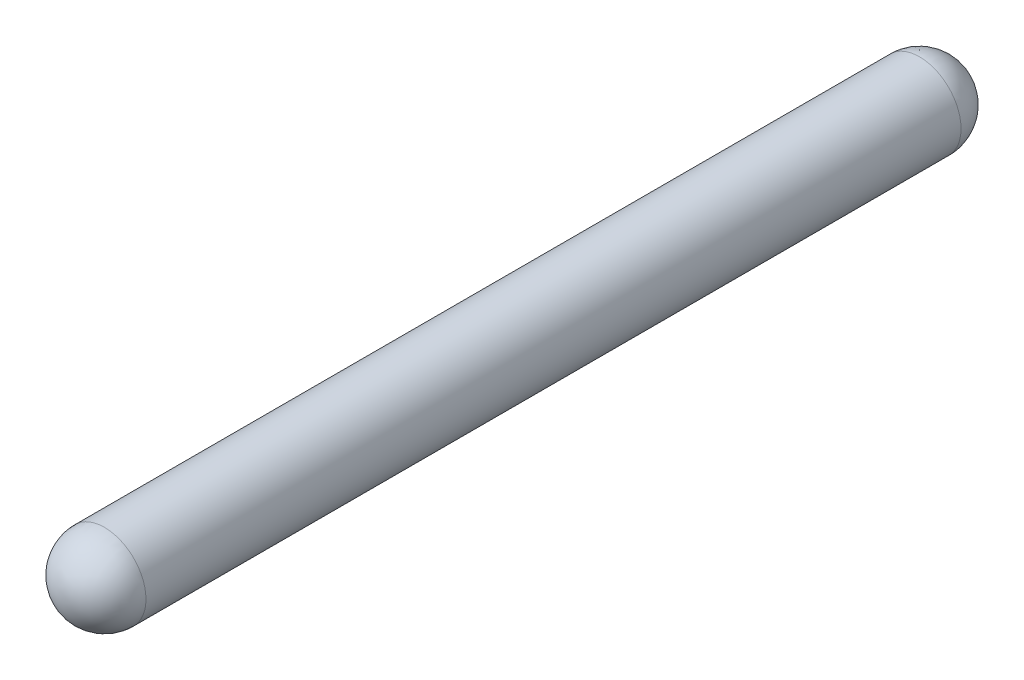
ISO-10303-21;
HEADER;
FILE_DESCRIPTION(('STEP AP214'),'2;1');
FILE_NAME('part.step','',(''),(''),'','','');
FILE_SCHEMA(('AUTOMOTIVE_DESIGN { 1 0 10303 214 1 1 1 1 }'));
ENDSEC;
DATA;
#1=APPLICATION_CONTEXT('core data for automotive mechanical design processes');
#2=APPLICATION_PROTOCOL_DEFINITION('international standard','automotive_design',2000,#1);
#3=PRODUCT_CONTEXT('',#1,'mechanical');
#4=PRODUCT('Part','Part','',(#3));
#5=PRODUCT_RELATED_PRODUCT_CATEGORY('part','',(#4));
#6=PRODUCT_DEFINITION_FORMATION('','',#4);
#7=PRODUCT_DEFINITION_CONTEXT('part definition',#1,'design');
#8=PRODUCT_DEFINITION('design','',#6,#7);
#9=PRODUCT_DEFINITION_SHAPE('','',#8);
#10=(LENGTH_UNIT() NAMED_UNIT(*) SI_UNIT(.MILLI.,.METRE.));
#11=(NAMED_UNIT(*) PLANE_ANGLE_UNIT() SI_UNIT($,.RADIAN.));
#12=(NAMED_UNIT(*) SI_UNIT($,.STERADIAN.) SOLID_ANGLE_UNIT());
#13=UNCERTAINTY_MEASURE_WITH_UNIT(LENGTH_MEASURE(1.E-05),#10,'distance_accuracy_value','');
#14=(GEOMETRIC_REPRESENTATION_CONTEXT(3) GLOBAL_UNCERTAINTY_ASSIGNED_CONTEXT((#13)) GLOBAL_UNIT_ASSIGNED_CONTEXT((#10,
#11,#12)) REPRESENTATION_CONTEXT('',''));
#15=CARTESIAN_POINT('',(0.,0.,0.));
#16=DIRECTION('',(0.,0.,1.));
#17=DIRECTION('',(1.,0.,0.));
#18=AXIS2_PLACEMENT_3D('',#15,#16,#17);
#19=CARTESIAN_POINT('',(2.54,0.,-3.));
#20=DIRECTION('',(1.,0.,0.));
#21=DIRECTION('',(0.,-1.,0.));
#22=AXIS2_PLACEMENT_3D('',#19,#20,#21);
#23=SPHERICAL_SURFACE('',#22,0.331);
#24=CARTESIAN_POINT('',(2.54,0.,-3.));
#25=DIRECTION('',(0.,0.,1.));
#26=DIRECTION('',(1.,0.,0.));
#27=AXIS2_PLACEMENT_3D('',#24,#25,#26);
#28=CIRCLE('',#27,0.331);
#29=CARTESIAN_POINT('',(2.871,0.,-3.));
#30=VERTEX_POINT('',#29);
#31=CARTESIAN_POINT('',(2.209,0.,-3.));
#32=VERTEX_POINT('',#31);
#33=EDGE_CURVE('E42',#30,#32,#28,.T.);
#34=ORIENTED_EDGE('',*,*,#33,.F.);
#35=CARTESIAN_POINT('',(2.54,0.,-3.));
#36=DIRECTION('',(0.,0.,1.));
#37=DIRECTION('',(1.,0.,0.));
#38=AXIS2_PLACEMENT_3D('',#35,#36,#37);
#39=CIRCLE('',#38,0.331);
#40=EDGE_CURVE('E26',#32,#30,#39,.T.);
#41=ORIENTED_EDGE('',*,*,#40,.F.);
#42=EDGE_LOOP('',(#34,#41));
#43=FACE_BOUND('',#42,.T.);
#44=ADVANCED_FACE('F17',(#43),#23,.T.);
#45=CARTESIAN_POINT('',(2.54,0.,3.5));
#46=DIRECTION('',(1.,0.,0.));
#47=DIRECTION('',(0.,1.,0.));
#48=AXIS2_PLACEMENT_3D('',#45,#46,#47);
#49=SPHERICAL_SURFACE('',#48,0.331);
#50=CARTESIAN_POINT('',(2.54,0.,3.5));
#51=DIRECTION('',(0.,0.,1.));
#52=DIRECTION('',(1.,0.,0.));
#53=AXIS2_PLACEMENT_3D('',#50,#51,#52);
#54=CIRCLE('',#53,0.331);
#55=CARTESIAN_POINT('',(2.871,0.,3.5));
#56=VERTEX_POINT('',#55);
#57=CARTESIAN_POINT('',(2.209,0.,3.5));
#58=VERTEX_POINT('',#57);
#59=EDGE_CURVE('E11',#56,#58,#54,.F.);
#60=ORIENTED_EDGE('',*,*,#59,.F.);
#61=CARTESIAN_POINT('',(2.54,0.,3.5));
#62=DIRECTION('',(0.,0.,1.));
#63=DIRECTION('',(1.,0.,0.));
#64=AXIS2_PLACEMENT_3D('',#61,#62,#63);
#65=CIRCLE('',#64,0.331);
#66=EDGE_CURVE('E34',#58,#56,#65,.F.);
#67=ORIENTED_EDGE('',*,*,#66,.F.);
#68=EDGE_LOOP('',(#60,#67));
#69=FACE_BOUND('',#68,.T.);
#70=ADVANCED_FACE('F49',(#69),#49,.T.);
#71=CARTESIAN_POINT('',(2.54,0.,-3.));
#72=DIRECTION('',(0.,0.,1.));
#73=DIRECTION('',(1.,0.,0.));
#74=AXIS2_PLACEMENT_3D('',#71,#72,#73);
#75=CYLINDRICAL_SURFACE('',#74,0.331);
#76=ORIENTED_EDGE('',*,*,#66,.T.);
#77=ORIENTED_EDGE('',*,*,#59,.T.);
#78=EDGE_LOOP('',(#76,#77));
#79=FACE_BOUND('',#78,.T.);
#80=ORIENTED_EDGE('',*,*,#40,.T.);
#81=ORIENTED_EDGE('',*,*,#33,.T.);
#82=EDGE_LOOP('',(#80,#81));
#83=FACE_BOUND('',#82,.T.);
#84=ADVANCED_FACE('F45',(#79,#83),#75,.T.);
#85=CLOSED_SHELL('',(#44,#70,#84));
#86=MANIFOLD_SOLID_BREP('B1',#85);
#87=ADVANCED_BREP_SHAPE_REPRESENTATION('',(#18,#86),#14);
#88=SHAPE_DEFINITION_REPRESENTATION(#9,#87);
ENDSEC;
END-ISO-10303-21;
